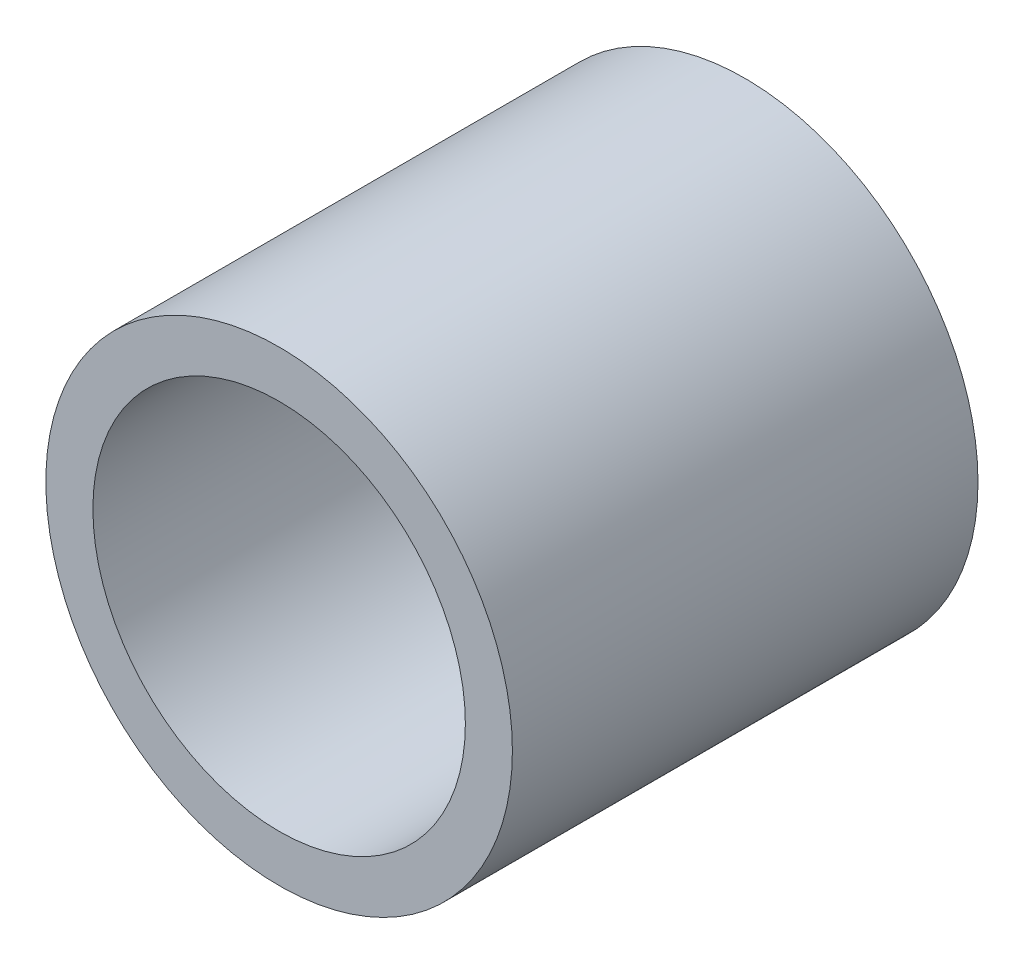
ISO-10303-21;
HEADER;
FILE_DESCRIPTION(('STEP AP214'),'2;1');
FILE_NAME('part.step','',(''),(''),'','','');
FILE_SCHEMA(('AUTOMOTIVE_DESIGN { 1 0 10303 214 1 1 1 1 }'));
ENDSEC;
DATA;
#1=APPLICATION_CONTEXT('core data for automotive mechanical design processes');
#2=APPLICATION_PROTOCOL_DEFINITION('international standard','automotive_design',2000,#1);
#3=PRODUCT_CONTEXT('',#1,'mechanical');
#4=PRODUCT('Part','Part','',(#3));
#5=PRODUCT_RELATED_PRODUCT_CATEGORY('part','',(#4));
#6=PRODUCT_DEFINITION_FORMATION('','',#4);
#7=PRODUCT_DEFINITION_CONTEXT('part definition',#1,'design');
#8=PRODUCT_DEFINITION('design','',#6,#7);
#9=PRODUCT_DEFINITION_SHAPE('','',#8);
#10=(LENGTH_UNIT() NAMED_UNIT(*) SI_UNIT(.MILLI.,.METRE.));
#11=(NAMED_UNIT(*) PLANE_ANGLE_UNIT() SI_UNIT($,.RADIAN.));
#12=(NAMED_UNIT(*) SI_UNIT($,.STERADIAN.) SOLID_ANGLE_UNIT());
#13=UNCERTAINTY_MEASURE_WITH_UNIT(LENGTH_MEASURE(1.E-05),#10,'distance_accuracy_value','');
#14=(GEOMETRIC_REPRESENTATION_CONTEXT(3) GLOBAL_UNCERTAINTY_ASSIGNED_CONTEXT((#13)) GLOBAL_UNIT_ASSIGNED_CONTEXT((#10,
#11,#12)) REPRESENTATION_CONTEXT('',''));
#15=CARTESIAN_POINT('',(0.,0.,0.));
#16=DIRECTION('',(0.,0.,1.));
#17=DIRECTION('',(1.,0.,0.));
#18=AXIS2_PLACEMENT_3D('',#15,#16,#17);
#19=CARTESIAN_POINT('',(0.,0.,15.875));
#20=DIRECTION('',(0.,0.,1.));
#21=DIRECTION('',(1.,0.,0.));
#22=AXIS2_PLACEMENT_3D('',#19,#20,#21);
#23=PLANE('',#22);
#24=CARTESIAN_POINT('',(0.,0.,15.875));
#25=DIRECTION('',(0.,0.,1.));
#26=DIRECTION('',(1.,0.,0.));
#27=AXIS2_PLACEMENT_3D('',#24,#25,#26);
#28=CIRCLE('',#27,7.95401);
#29=CARTESIAN_POINT('',(7.95401,0.,15.875));
#30=VERTEX_POINT('',#29);
#31=EDGE_CURVE('E10',#30,#30,#28,.T.);
#32=ORIENTED_EDGE('',*,*,#31,.T.);
#33=EDGE_LOOP('',(#32));
#34=FACE_BOUND('',#33,.T.);
#35=CARTESIAN_POINT('',(0.,0.,15.875));
#36=DIRECTION('',(0.,0.,1.));
#37=DIRECTION('',(1.,0.,0.));
#38=AXIS2_PLACEMENT_3D('',#35,#36,#37);
#39=CIRCLE('',#38,6.35);
#40=CARTESIAN_POINT('',(6.35,0.,15.875));
#41=VERTEX_POINT('',#40);
#42=EDGE_CURVE('E46',#41,#41,#39,.T.);
#43=ORIENTED_EDGE('',*,*,#42,.F.);
#44=EDGE_LOOP('',(#43));
#45=FACE_BOUND('',#44,.T.);
#46=ADVANCED_FACE('F35',(#34,#45),#23,.T.);
#47=CARTESIAN_POINT('',(0.,0.,0.));
#48=DIRECTION('',(0.,0.,1.));
#49=DIRECTION('',(1.,0.,0.));
#50=AXIS2_PLACEMENT_3D('',#47,#48,#49);
#51=PLANE('',#50);
#52=CARTESIAN_POINT('',(0.,0.,0.));
#53=DIRECTION('',(0.,0.,1.));
#54=DIRECTION('',(1.,0.,0.));
#55=AXIS2_PLACEMENT_3D('',#52,#53,#54);
#56=CIRCLE('',#55,7.95401);
#57=CARTESIAN_POINT('',(7.95401,0.,0.));
#58=VERTEX_POINT('',#57);
#59=EDGE_CURVE('E39',#58,#58,#56,.T.);
#60=ORIENTED_EDGE('',*,*,#59,.F.);
#61=EDGE_LOOP('',(#60));
#62=FACE_BOUND('',#61,.T.);
#63=CARTESIAN_POINT('',(0.,0.,0.));
#64=DIRECTION('',(0.,0.,1.));
#65=DIRECTION('',(1.,0.,0.));
#66=AXIS2_PLACEMENT_3D('',#63,#64,#65);
#67=CIRCLE('',#66,6.35);
#68=CARTESIAN_POINT('',(6.35,0.,0.));
#69=VERTEX_POINT('',#68);
#70=EDGE_CURVE('E48',#69,#69,#67,.T.);
#71=ORIENTED_EDGE('',*,*,#70,.T.);
#72=EDGE_LOOP('',(#71));
#73=FACE_BOUND('',#72,.T.);
#74=ADVANCED_FACE('F58',(#62,#73),#51,.F.);
#75=CARTESIAN_POINT('',(0.,0.,15.875));
#76=DIRECTION('',(0.,0.,-1.));
#77=DIRECTION('',(-1.,0.,0.));
#78=AXIS2_PLACEMENT_3D('',#75,#76,#77);
#79=CYLINDRICAL_SURFACE('',#78,7.95401);
#80=ORIENTED_EDGE('',*,*,#31,.F.);
#81=EDGE_LOOP('',(#80));
#82=FACE_BOUND('',#81,.T.);
#83=ORIENTED_EDGE('',*,*,#59,.T.);
#84=EDGE_LOOP('',(#83));
#85=FACE_BOUND('',#84,.T.);
#86=ADVANCED_FACE('F37',(#82,#85),#79,.T.);
#87=CARTESIAN_POINT('',(0.,0.,15.875));
#88=DIRECTION('',(0.,0.,-1.));
#89=DIRECTION('',(-1.,0.,0.));
#90=AXIS2_PLACEMENT_3D('',#87,#88,#89);
#91=CYLINDRICAL_SURFACE('',#90,6.35);
#92=ORIENTED_EDGE('',*,*,#42,.T.);
#93=EDGE_LOOP('',(#92));
#94=FACE_BOUND('',#93,.T.);
#95=ORIENTED_EDGE('',*,*,#70,.F.);
#96=EDGE_LOOP('',(#95));
#97=FACE_BOUND('',#96,.T.);
#98=ADVANCED_FACE('F54',(#94,#97),#91,.F.);
#99=CLOSED_SHELL('',(#46,#74,#86,#98));
#100=MANIFOLD_SOLID_BREP('B2',#99);
#101=ADVANCED_BREP_SHAPE_REPRESENTATION('',(#18,#100),#14);
#102=SHAPE_DEFINITION_REPRESENTATION(#9,#101);
ENDSEC;
END-ISO-10303-21;
